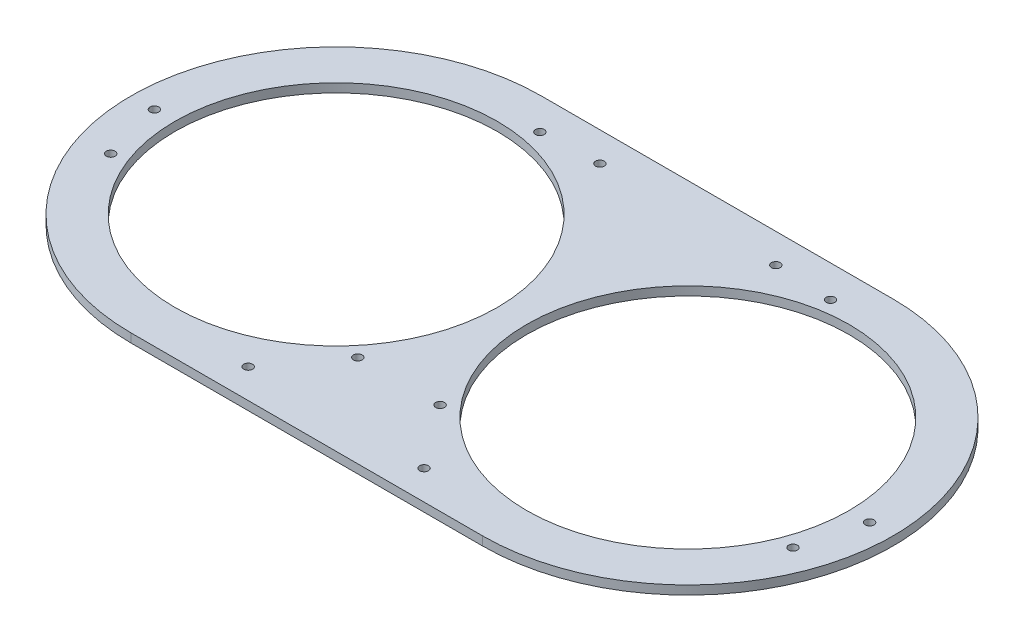
ISO-10303-21;
HEADER;
FILE_DESCRIPTION(('STEP AP214'),'2;1');
FILE_NAME('part.step','',(''),(''),'','','');
FILE_SCHEMA(('AUTOMOTIVE_DESIGN { 1 0 10303 214 1 1 1 1 }'));
ENDSEC;
DATA;
#1=APPLICATION_CONTEXT('core data for automotive mechanical design processes');
#2=APPLICATION_PROTOCOL_DEFINITION('international standard','automotive_design',2000,#1);
#3=PRODUCT_CONTEXT('',#1,'mechanical');
#4=PRODUCT('Part','Part','',(#3));
#5=PRODUCT_RELATED_PRODUCT_CATEGORY('part','',(#4));
#6=PRODUCT_DEFINITION_FORMATION('','',#4);
#7=PRODUCT_DEFINITION_CONTEXT('part definition',#1,'design');
#8=PRODUCT_DEFINITION('design','',#6,#7);
#9=PRODUCT_DEFINITION_SHAPE('','',#8);
#10=(LENGTH_UNIT() NAMED_UNIT(*) SI_UNIT(.MILLI.,.METRE.));
#11=(NAMED_UNIT(*) PLANE_ANGLE_UNIT() SI_UNIT($,.RADIAN.));
#12=(NAMED_UNIT(*) SI_UNIT($,.STERADIAN.) SOLID_ANGLE_UNIT());
#13=UNCERTAINTY_MEASURE_WITH_UNIT(LENGTH_MEASURE(1.E-05),#10,'distance_accuracy_value','');
#14=(GEOMETRIC_REPRESENTATION_CONTEXT(3) GLOBAL_UNCERTAINTY_ASSIGNED_CONTEXT((#13)) GLOBAL_UNIT_ASSIGNED_CONTEXT((#10,
#11,#12)) REPRESENTATION_CONTEXT('',''));
#15=CARTESIAN_POINT('',(0.,0.,0.));
#16=DIRECTION('',(0.,0.,1.));
#17=DIRECTION('',(1.,0.,0.));
#18=AXIS2_PLACEMENT_3D('',#15,#16,#17);
#19=CARTESIAN_POINT('',(0.,3.,70.));
#20=DIRECTION('',(0.,0.,-1.));
#21=DIRECTION('',(-1.,0.,0.));
#22=AXIS2_PLACEMENT_3D('',#19,#20,#21);
#23=PLANE('',#22);
#24=DIRECTION('',(1.,0.,0.));
#25=VECTOR('',#24,1.);
#26=CARTESIAN_POINT('',(0.,0.,70.));
#27=LINE('',#26,#25);
#28=CARTESIAN_POINT('',(-60.,0.,70.));
#29=VERTEX_POINT('',#28);
#30=CARTESIAN_POINT('',(60.,0.,70.));
#31=VERTEX_POINT('',#30);
#32=EDGE_CURVE('E166',#29,#31,#27,.T.);
#33=ORIENTED_EDGE('',*,*,#32,.T.);
#34=DIRECTION('',(0.,-1.,0.));
#35=VECTOR('',#34,1.);
#36=CARTESIAN_POINT('',(60.,3.,70.));
#37=LINE('',#36,#35);
#38=CARTESIAN_POINT('',(60.,3.,70.));
#39=VERTEX_POINT('',#38);
#40=EDGE_CURVE('E11',#39,#31,#37,.T.);
#41=ORIENTED_EDGE('',*,*,#40,.F.);
#42=DIRECTION('',(1.,0.,0.));
#43=VECTOR('',#42,1.);
#44=CARTESIAN_POINT('',(0.,3.,70.));
#45=LINE('',#44,#43);
#46=CARTESIAN_POINT('',(-60.,3.,70.));
#47=VERTEX_POINT('',#46);
#48=EDGE_CURVE('E91',#47,#39,#45,.T.);
#49=ORIENTED_EDGE('',*,*,#48,.F.);
#50=DIRECTION('',(0.,-1.,0.));
#51=VECTOR('',#50,1.);
#52=CARTESIAN_POINT('',(-60.,3.,70.));
#53=LINE('',#52,#51);
#54=EDGE_CURVE('E153',#47,#29,#53,.T.);
#55=ORIENTED_EDGE('',*,*,#54,.T.);
#56=EDGE_LOOP('',(#33,#41,#49,#55));
#57=FACE_BOUND('',#56,.T.);
#58=ADVANCED_FACE('F41',(#57),#23,.F.);
#59=CARTESIAN_POINT('',(60.,3.,0.));
#60=DIRECTION('',(0.,-1.,0.));
#61=DIRECTION('',(0.,0.,-1.));
#62=AXIS2_PLACEMENT_3D('',#59,#60,#61);
#63=CYLINDRICAL_SURFACE('',#62,70.);
#64=CARTESIAN_POINT('',(60.,0.,0.));
#65=DIRECTION('',(0.,1.,0.));
#66=DIRECTION('',(0.,0.,1.));
#67=AXIS2_PLACEMENT_3D('',#64,#65,#66);
#68=CIRCLE('',#67,70.);
#69=CARTESIAN_POINT('',(60.,0.,-70.));
#70=VERTEX_POINT('',#69);
#71=EDGE_CURVE('E97',#31,#70,#68,.T.);
#72=ORIENTED_EDGE('',*,*,#71,.T.);
#73=DIRECTION('',(0.,-1.,0.));
#74=VECTOR('',#73,1.);
#75=CARTESIAN_POINT('',(60.,3.,-70.));
#76=LINE('',#75,#74);
#77=CARTESIAN_POINT('',(60.,3.,-70.));
#78=VERTEX_POINT('',#77);
#79=EDGE_CURVE('E51',#78,#70,#76,.T.);
#80=ORIENTED_EDGE('',*,*,#79,.F.);
#81=CARTESIAN_POINT('',(60.,3.,0.));
#82=DIRECTION('',(0.,1.,0.));
#83=DIRECTION('',(0.,0.,1.));
#84=AXIS2_PLACEMENT_3D('',#81,#82,#83);
#85=CIRCLE('',#84,70.);
#86=EDGE_CURVE('E85',#39,#78,#85,.T.);
#87=ORIENTED_EDGE('',*,*,#86,.F.);
#88=ORIENTED_EDGE('',*,*,#40,.T.);
#89=EDGE_LOOP('',(#72,#80,#87,#88));
#90=FACE_BOUND('',#89,.T.);
#91=ADVANCED_FACE('F96',(#90),#63,.T.);
#92=CARTESIAN_POINT('',(0.,3.,-70.));
#93=DIRECTION('',(0.,0.,-1.));
#94=DIRECTION('',(-1.,0.,0.));
#95=AXIS2_PLACEMENT_3D('',#92,#93,#94);
#96=PLANE('',#95);
#97=DIRECTION('',(1.,0.,0.));
#98=VECTOR('',#97,1.);
#99=CARTESIAN_POINT('',(0.,0.,-70.));
#100=LINE('',#99,#98);
#101=CARTESIAN_POINT('',(-60.,0.,-70.));
#102=VERTEX_POINT('',#101);
#103=EDGE_CURVE('E172',#102,#70,#100,.T.);
#104=ORIENTED_EDGE('',*,*,#103,.F.);
#105=DIRECTION('',(0.,-1.,0.));
#106=VECTOR('',#105,1.);
#107=CARTESIAN_POINT('',(-60.,3.,-70.));
#108=LINE('',#107,#106);
#109=CARTESIAN_POINT('',(-60.,3.,-70.));
#110=VERTEX_POINT('',#109);
#111=EDGE_CURVE('E75',#110,#102,#108,.T.);
#112=ORIENTED_EDGE('',*,*,#111,.F.);
#113=DIRECTION('',(1.,0.,0.));
#114=VECTOR('',#113,1.);
#115=CARTESIAN_POINT('',(0.,3.,-70.));
#116=LINE('',#115,#114);
#117=EDGE_CURVE('E89',#110,#78,#116,.T.);
#118=ORIENTED_EDGE('',*,*,#117,.T.);
#119=ORIENTED_EDGE('',*,*,#79,.T.);
#120=EDGE_LOOP('',(#104,#112,#118,#119));
#121=FACE_BOUND('',#120,.T.);
#122=ADVANCED_FACE('F102',(#121),#96,.T.);
#123=CARTESIAN_POINT('',(14.0373334128611,3.,38.5672565811921));
#124=DIRECTION('',(0.,-1.,0.));
#125=DIRECTION('',(0.,0.,-1.));
#126=AXIS2_PLACEMENT_3D('',#123,#124,#125);
#127=CYLINDRICAL_SURFACE('',#126,1.5);
#128=CARTESIAN_POINT('',(14.0373334128611,3.,38.5672565811921));
#129=DIRECTION('',(0.,1.,0.));
#130=DIRECTION('',(0.,0.,1.));
#131=AXIS2_PLACEMENT_3D('',#128,#129,#130);
#132=CIRCLE('',#131,1.5);
#133=CARTESIAN_POINT('',(14.0373334128611,3.,40.0672565811921));
#134=VERTEX_POINT('',#133);
#135=EDGE_CURVE('E145',#134,#134,#132,.F.);
#136=ORIENTED_EDGE('',*,*,#135,.F.);
#137=EDGE_LOOP('',(#136));
#138=FACE_BOUND('',#137,.T.);
#139=CARTESIAN_POINT('',(14.0373334128611,0.,38.5672565811921));
#140=DIRECTION('',(0.,1.,0.));
#141=DIRECTION('',(0.,0.,1.));
#142=AXIS2_PLACEMENT_3D('',#139,#140,#141);
#143=CIRCLE('',#142,1.5);
#144=CARTESIAN_POINT('',(14.0373334128611,0.,40.0672565811921));
#145=VERTEX_POINT('',#144);
#146=EDGE_CURVE('E213',#145,#145,#143,.F.);
#147=ORIENTED_EDGE('',*,*,#146,.T.);
#148=EDGE_LOOP('',(#147));
#149=FACE_BOUND('',#148,.T.);
#150=ADVANCED_FACE('F428',(#138,#149),#127,.F.);
#151=CARTESIAN_POINT('',(-14.0373334128611,3.,38.5672565811921));
#152=DIRECTION('',(0.,-1.,0.));
#153=DIRECTION('',(0.,0.,-1.));
#154=AXIS2_PLACEMENT_3D('',#151,#152,#153);
#155=CYLINDRICAL_SURFACE('',#154,1.5);
#156=CARTESIAN_POINT('',(-14.0373334128611,3.,38.5672565811921));
#157=DIRECTION('',(0.,1.,0.));
#158=DIRECTION('',(0.,0.,1.));
#159=AXIS2_PLACEMENT_3D('',#156,#157,#158);
#160=CIRCLE('',#159,1.5);
#161=CARTESIAN_POINT('',(-14.0373334128611,3.,40.0672565811921));
#162=VERTEX_POINT('',#161);
#163=EDGE_CURVE('E141',#162,#162,#160,.T.);
#164=ORIENTED_EDGE('',*,*,#163,.T.);
#165=EDGE_LOOP('',(#164));
#166=FACE_BOUND('',#165,.T.);
#167=CARTESIAN_POINT('',(-14.0373334128611,0.,38.5672565811921));
#168=DIRECTION('',(0.,1.,0.));
#169=DIRECTION('',(0.,0.,1.));
#170=AXIS2_PLACEMENT_3D('',#167,#168,#169);
#171=CIRCLE('',#170,1.5);
#172=CARTESIAN_POINT('',(-14.0373334128611,0.,40.0672565811921));
#173=VERTEX_POINT('',#172);
#174=EDGE_CURVE('E209',#173,#173,#171,.T.);
#175=ORIENTED_EDGE('',*,*,#174,.F.);
#176=EDGE_LOOP('',(#175));
#177=FACE_BOUND('',#176,.T.);
#178=ADVANCED_FACE('F419',(#166,#177),#155,.F.);
#179=CARTESIAN_POINT('',(-116.381557247154,3.,20.5212085995402));
#180=DIRECTION('',(0.,-1.,0.));
#181=DIRECTION('',(0.,0.,-1.));
#182=AXIS2_PLACEMENT_3D('',#179,#180,#181);
#183=CYLINDRICAL_SURFACE('',#182,1.5);
#184=CARTESIAN_POINT('',(-116.381557247154,3.,20.5212085995402));
#185=DIRECTION('',(0.,1.,0.));
#186=DIRECTION('',(0.,0.,1.));
#187=AXIS2_PLACEMENT_3D('',#184,#185,#186);
#188=CIRCLE('',#187,1.5);
#189=CARTESIAN_POINT('',(-116.381557247154,3.,22.0212085995402));
#190=VERTEX_POINT('',#189);
#191=EDGE_CURVE('E137',#190,#190,#188,.T.);
#192=ORIENTED_EDGE('',*,*,#191,.T.);
#193=EDGE_LOOP('',(#192));
#194=FACE_BOUND('',#193,.T.);
#195=CARTESIAN_POINT('',(-116.381557247154,0.,20.5212085995402));
#196=DIRECTION('',(0.,1.,0.));
#197=DIRECTION('',(0.,0.,1.));
#198=AXIS2_PLACEMENT_3D('',#195,#196,#197);
#199=CIRCLE('',#198,1.5);
#200=CARTESIAN_POINT('',(-116.381557247154,0.,22.0212085995402));
#201=VERTEX_POINT('',#200);
#202=EDGE_CURVE('E205',#201,#201,#199,.T.);
#203=ORIENTED_EDGE('',*,*,#202,.F.);
#204=EDGE_LOOP('',(#203));
#205=FACE_BOUND('',#204,.T.);
#206=ADVANCED_FACE('F410',(#194,#205),#183,.F.);
#207=CARTESIAN_POINT('',(-49.5811093399839,3.,-59.0884651807324));
#208=DIRECTION('',(0.,-1.,0.));
#209=DIRECTION('',(0.,0.,-1.));
#210=AXIS2_PLACEMENT_3D('',#207,#208,#209);
#211=CYLINDRICAL_SURFACE('',#210,1.5);
#212=CARTESIAN_POINT('',(-49.5811093399839,3.,-59.0884651807324));
#213=DIRECTION('',(0.,1.,0.));
#214=DIRECTION('',(0.,0.,1.));
#215=AXIS2_PLACEMENT_3D('',#212,#213,#214);
#216=CIRCLE('',#215,1.5);
#217=CARTESIAN_POINT('',(-49.5811093399839,3.,-57.5884651807324));
#218=VERTEX_POINT('',#217);
#219=EDGE_CURVE('E133',#218,#218,#216,.T.);
#220=ORIENTED_EDGE('',*,*,#219,.T.);
#221=EDGE_LOOP('',(#220));
#222=FACE_BOUND('',#221,.T.);
#223=CARTESIAN_POINT('',(-49.5811093399839,0.,-59.0884651807324));
#224=DIRECTION('',(0.,1.,0.));
#225=DIRECTION('',(0.,0.,1.));
#226=AXIS2_PLACEMENT_3D('',#223,#224,#225);
#227=CIRCLE('',#226,1.5);
#228=CARTESIAN_POINT('',(-49.5811093399839,0.,-57.5884651807324));
#229=VERTEX_POINT('',#228);
#230=EDGE_CURVE('E201',#229,#229,#227,.T.);
#231=ORIENTED_EDGE('',*,*,#230,.F.);
#232=EDGE_LOOP('',(#231));
#233=FACE_BOUND('',#232,.T.);
#234=ADVANCED_FACE('F401',(#222,#233),#211,.F.);
#235=CARTESIAN_POINT('',(30.,3.,-60.));
#236=DIRECTION('',(0.,-1.,0.));
#237=DIRECTION('',(0.,0.,-1.));
#238=AXIS2_PLACEMENT_3D('',#235,#236,#237);
#239=CYLINDRICAL_SURFACE('',#238,1.5);
#240=CARTESIAN_POINT('',(30.,3.,-60.));
#241=DIRECTION('',(0.,1.,0.));
#242=DIRECTION('',(0.,0.,1.));
#243=AXIS2_PLACEMENT_3D('',#240,#241,#242);
#244=CIRCLE('',#243,1.5);
#245=CARTESIAN_POINT('',(30.,3.,-58.5));
#246=VERTEX_POINT('',#245);
#247=EDGE_CURVE('E129',#246,#246,#244,.F.);
#248=ORIENTED_EDGE('',*,*,#247,.F.);
#249=EDGE_LOOP('',(#248));
#250=FACE_BOUND('',#249,.T.);
#251=CARTESIAN_POINT('',(30.,0.,-60.));
#252=DIRECTION('',(0.,1.,0.));
#253=DIRECTION('',(0.,0.,1.));
#254=AXIS2_PLACEMENT_3D('',#251,#252,#253);
#255=CIRCLE('',#254,1.5);
#256=CARTESIAN_POINT('',(30.,0.,-58.5));
#257=VERTEX_POINT('',#256);
#258=EDGE_CURVE('E197',#257,#257,#255,.F.);
#259=ORIENTED_EDGE('',*,*,#258,.T.);
#260=EDGE_LOOP('',(#259));
#261=FACE_BOUND('',#260,.T.);
#262=ADVANCED_FACE('F392',(#250,#261),#239,.F.);
#263=CARTESIAN_POINT('',(-30.,3.,-60.));
#264=DIRECTION('',(0.,-1.,0.));
#265=DIRECTION('',(0.,0.,-1.));
#266=AXIS2_PLACEMENT_3D('',#263,#264,#265);
#267=CYLINDRICAL_SURFACE('',#266,1.5);
#268=CARTESIAN_POINT('',(-30.,3.,-60.));
#269=DIRECTION('',(0.,1.,0.));
#270=DIRECTION('',(0.,0.,1.));
#271=AXIS2_PLACEMENT_3D('',#268,#269,#270);
#272=CIRCLE('',#271,1.5);
#273=CARTESIAN_POINT('',(-30.,3.,-58.5));
#274=VERTEX_POINT('',#273);
#275=EDGE_CURVE('E125',#274,#274,#272,.T.);
#276=ORIENTED_EDGE('',*,*,#275,.T.);
#277=EDGE_LOOP('',(#276));
#278=FACE_BOUND('',#277,.T.);
#279=CARTESIAN_POINT('',(-30.,0.,-60.));
#280=DIRECTION('',(0.,1.,0.));
#281=DIRECTION('',(0.,0.,1.));
#282=AXIS2_PLACEMENT_3D('',#279,#280,#281);
#283=CIRCLE('',#282,1.5);
#284=CARTESIAN_POINT('',(-30.,0.,-58.5));
#285=VERTEX_POINT('',#284);
#286=EDGE_CURVE('E193',#285,#285,#283,.T.);
#287=ORIENTED_EDGE('',*,*,#286,.F.);
#288=EDGE_LOOP('',(#287));
#289=FACE_BOUND('',#288,.T.);
#290=ADVANCED_FACE('F383',(#278,#289),#267,.F.);
#291=CARTESIAN_POINT('',(122.,3.,0.));
#292=DIRECTION('',(0.,-1.,0.));
#293=DIRECTION('',(0.,0.,-1.));
#294=AXIS2_PLACEMENT_3D('',#291,#292,#293);
#295=CYLINDRICAL_SURFACE('',#294,1.5);
#296=CARTESIAN_POINT('',(122.,3.,0.));
#297=DIRECTION('',(0.,1.,0.));
#298=DIRECTION('',(0.,0.,1.));
#299=AXIS2_PLACEMENT_3D('',#296,#297,#298);
#300=CIRCLE('',#299,1.5);
#301=CARTESIAN_POINT('',(122.,3.,1.5));
#302=VERTEX_POINT('',#301);
#303=EDGE_CURVE('E121',#302,#302,#300,.T.);
#304=ORIENTED_EDGE('',*,*,#303,.T.);
#305=EDGE_LOOP('',(#304));
#306=FACE_BOUND('',#305,.T.);
#307=CARTESIAN_POINT('',(122.,0.,0.));
#308=DIRECTION('',(0.,1.,0.));
#309=DIRECTION('',(0.,0.,1.));
#310=AXIS2_PLACEMENT_3D('',#307,#308,#309);
#311=CIRCLE('',#310,1.5);
#312=CARTESIAN_POINT('',(122.,0.,1.5));
#313=VERTEX_POINT('',#312);
#314=EDGE_CURVE('E189',#313,#313,#311,.T.);
#315=ORIENTED_EDGE('',*,*,#314,.F.);
#316=EDGE_LOOP('',(#315));
#317=FACE_BOUND('',#316,.T.);
#318=ADVANCED_FACE('F374',(#306,#317),#295,.F.);
#319=CARTESIAN_POINT('',(-122.,3.,0.));
#320=DIRECTION('',(0.,-1.,0.));
#321=DIRECTION('',(0.,0.,-1.));
#322=AXIS2_PLACEMENT_3D('',#319,#320,#321);
#323=CYLINDRICAL_SURFACE('',#322,1.5);
#324=CARTESIAN_POINT('',(-122.,3.,0.));
#325=DIRECTION('',(0.,1.,0.));
#326=DIRECTION('',(0.,0.,1.));
#327=AXIS2_PLACEMENT_3D('',#324,#325,#326);
#328=CIRCLE('',#327,1.5);
#329=CARTESIAN_POINT('',(-122.,3.,1.5));
#330=VERTEX_POINT('',#329);
#331=EDGE_CURVE('E117',#330,#330,#328,.T.);
#332=ORIENTED_EDGE('',*,*,#331,.T.);
#333=EDGE_LOOP('',(#332));
#334=FACE_BOUND('',#333,.T.);
#335=CARTESIAN_POINT('',(-122.,0.,0.));
#336=DIRECTION('',(0.,1.,0.));
#337=DIRECTION('',(0.,0.,1.));
#338=AXIS2_PLACEMENT_3D('',#335,#336,#337);
#339=CIRCLE('',#338,1.5);
#340=CARTESIAN_POINT('',(-122.,0.,1.5));
#341=VERTEX_POINT('',#340);
#342=EDGE_CURVE('E185',#341,#341,#339,.T.);
#343=ORIENTED_EDGE('',*,*,#342,.F.);
#344=EDGE_LOOP('',(#343));
#345=FACE_BOUND('',#344,.T.);
#346=ADVANCED_FACE('F365',(#334,#345),#323,.F.);
#347=CARTESIAN_POINT('',(60.,3.,0.));
#348=DIRECTION('',(0.,-1.,0.));
#349=DIRECTION('',(0.,0.,-1.));
#350=AXIS2_PLACEMENT_3D('',#347,#348,#349);
#351=CYLINDRICAL_SURFACE('',#350,55.);
#352=CARTESIAN_POINT('',(60.,3.,0.));
#353=DIRECTION('',(0.,1.,0.));
#354=DIRECTION('',(0.,0.,1.));
#355=AXIS2_PLACEMENT_3D('',#352,#353,#354);
#356=CIRCLE('',#355,55.);
#357=CARTESIAN_POINT('',(60.,3.,55.));
#358=VERTEX_POINT('',#357);
#359=EDGE_CURVE('E113',#358,#358,#356,.F.);
#360=ORIENTED_EDGE('',*,*,#359,.F.);
#361=EDGE_LOOP('',(#360));
#362=FACE_BOUND('',#361,.T.);
#363=CARTESIAN_POINT('',(60.,0.,0.));
#364=DIRECTION('',(0.,1.,0.));
#365=DIRECTION('',(0.,0.,1.));
#366=AXIS2_PLACEMENT_3D('',#363,#364,#365);
#367=CIRCLE('',#366,55.);
#368=CARTESIAN_POINT('',(60.,0.,55.));
#369=VERTEX_POINT('',#368);
#370=EDGE_CURVE('E181',#369,#369,#367,.F.);
#371=ORIENTED_EDGE('',*,*,#370,.T.);
#372=EDGE_LOOP('',(#371));
#373=FACE_BOUND('',#372,.T.);
#374=ADVANCED_FACE('F356',(#362,#373),#351,.F.);
#375=CARTESIAN_POINT('',(-60.,3.,0.));
#376=DIRECTION('',(0.,-1.,0.));
#377=DIRECTION('',(0.,0.,-1.));
#378=AXIS2_PLACEMENT_3D('',#375,#376,#377);
#379=CYLINDRICAL_SURFACE('',#378,55.);
#380=CARTESIAN_POINT('',(-60.,3.,0.));
#381=DIRECTION('',(0.,1.,0.));
#382=DIRECTION('',(0.,0.,1.));
#383=AXIS2_PLACEMENT_3D('',#380,#381,#382);
#384=CIRCLE('',#383,55.);
#385=CARTESIAN_POINT('',(-60.,3.,55.));
#386=VERTEX_POINT('',#385);
#387=EDGE_CURVE('E106',#386,#386,#384,.T.);
#388=ORIENTED_EDGE('',*,*,#387,.T.);
#389=EDGE_LOOP('',(#388));
#390=FACE_BOUND('',#389,.T.);
#391=CARTESIAN_POINT('',(-60.,0.,0.));
#392=DIRECTION('',(0.,1.,0.));
#393=DIRECTION('',(0.,0.,1.));
#394=AXIS2_PLACEMENT_3D('',#391,#392,#393);
#395=CIRCLE('',#394,55.);
#396=CARTESIAN_POINT('',(-60.,0.,55.));
#397=VERTEX_POINT('',#396);
#398=EDGE_CURVE('E177',#397,#397,#395,.T.);
#399=ORIENTED_EDGE('',*,*,#398,.F.);
#400=EDGE_LOOP('',(#399));
#401=FACE_BOUND('',#400,.T.);
#402=ADVANCED_FACE('F348',(#390,#401),#379,.F.);
#403=CARTESIAN_POINT('',(-60.,3.,0.));
#404=DIRECTION('',(0.,-1.,0.));
#405=DIRECTION('',(0.,0.,-1.));
#406=AXIS2_PLACEMENT_3D('',#403,#404,#405);
#407=CYLINDRICAL_SURFACE('',#406,70.);
#408=CARTESIAN_POINT('',(-60.,0.,0.));
#409=DIRECTION('',(0.,1.,0.));
#410=DIRECTION('',(0.,0.,1.));
#411=AXIS2_PLACEMENT_3D('',#408,#409,#410);
#412=CIRCLE('',#411,70.);
#413=EDGE_CURVE('E78',#102,#29,#412,.T.);
#414=ORIENTED_EDGE('',*,*,#413,.T.);
#415=ORIENTED_EDGE('',*,*,#54,.F.);
#416=CARTESIAN_POINT('',(-60.,3.,0.));
#417=DIRECTION('',(0.,1.,0.));
#418=DIRECTION('',(0.,0.,1.));
#419=AXIS2_PLACEMENT_3D('',#416,#417,#418);
#420=CIRCLE('',#419,70.);
#421=EDGE_CURVE('E59',#110,#47,#420,.T.);
#422=ORIENTED_EDGE('',*,*,#421,.F.);
#423=ORIENTED_EDGE('',*,*,#111,.T.);
#424=EDGE_LOOP('',(#414,#415,#422,#423));
#425=FACE_BOUND('',#424,.T.);
#426=ADVANCED_FACE('F279',(#425),#407,.T.);
#427=CARTESIAN_POINT('',(30.,3.,60.));
#428=DIRECTION('',(0.,-1.,0.));
#429=DIRECTION('',(0.,0.,-1.));
#430=AXIS2_PLACEMENT_3D('',#427,#428,#429);
#431=CYLINDRICAL_SURFACE('',#430,1.5);
#432=CARTESIAN_POINT('',(30.,3.,60.));
#433=DIRECTION('',(0.,1.,0.));
#434=DIRECTION('',(0.,0.,1.));
#435=AXIS2_PLACEMENT_3D('',#432,#433,#434);
#436=CIRCLE('',#435,1.5);
#437=CARTESIAN_POINT('',(30.,3.,61.5));
#438=VERTEX_POINT('',#437);
#439=EDGE_CURVE('E296',#438,#438,#436,.T.);
#440=ORIENTED_EDGE('',*,*,#439,.T.);
#441=EDGE_LOOP('',(#440));
#442=FACE_BOUND('',#441,.T.);
#443=CARTESIAN_POINT('',(30.,0.,60.));
#444=DIRECTION('',(0.,1.,0.));
#445=DIRECTION('',(0.,0.,1.));
#446=AXIS2_PLACEMENT_3D('',#443,#444,#445);
#447=CIRCLE('',#446,1.5);
#448=CARTESIAN_POINT('',(30.,0.,61.5));
#449=VERTEX_POINT('',#448);
#450=EDGE_CURVE('E162',#449,#449,#447,.T.);
#451=ORIENTED_EDGE('',*,*,#450,.F.);
#452=EDGE_LOOP('',(#451));
#453=FACE_BOUND('',#452,.T.);
#454=ADVANCED_FACE('F277',(#442,#453),#431,.F.);
#455=CARTESIAN_POINT('',(-30.,3.,60.));
#456=DIRECTION('',(0.,-1.,0.));
#457=DIRECTION('',(0.,0.,-1.));
#458=AXIS2_PLACEMENT_3D('',#455,#456,#457);
#459=CYLINDRICAL_SURFACE('',#458,1.5);
#460=CARTESIAN_POINT('',(-30.,3.,60.));
#461=DIRECTION('',(0.,1.,0.));
#462=DIRECTION('',(0.,0.,1.));
#463=AXIS2_PLACEMENT_3D('',#460,#461,#462);
#464=CIRCLE('',#463,1.5);
#465=CARTESIAN_POINT('',(-30.,3.,61.5));
#466=VERTEX_POINT('',#465);
#467=EDGE_CURVE('E288',#466,#466,#464,.F.);
#468=ORIENTED_EDGE('',*,*,#467,.F.);
#469=EDGE_LOOP('',(#468));
#470=FACE_BOUND('',#469,.T.);
#471=CARTESIAN_POINT('',(-30.,0.,60.));
#472=DIRECTION('',(0.,1.,0.));
#473=DIRECTION('',(0.,0.,1.));
#474=AXIS2_PLACEMENT_3D('',#471,#472,#473);
#475=CIRCLE('',#474,1.5);
#476=CARTESIAN_POINT('',(-30.,0.,61.5));
#477=VERTEX_POINT('',#476);
#478=EDGE_CURVE('E158',#477,#477,#475,.F.);
#479=ORIENTED_EDGE('',*,*,#478,.T.);
#480=EDGE_LOOP('',(#479));
#481=FACE_BOUND('',#480,.T.);
#482=ADVANCED_FACE('F265',(#470,#481),#459,.F.);
#483=CARTESIAN_POINT('',(116.381557247154,3.,20.5212085995402));
#484=DIRECTION('',(0.,-1.,0.));
#485=DIRECTION('',(0.,0.,-1.));
#486=AXIS2_PLACEMENT_3D('',#483,#484,#485);
#487=CYLINDRICAL_SURFACE('',#486,1.5);
#488=CARTESIAN_POINT('',(116.381557247154,3.,20.5212085995402));
#489=DIRECTION('',(0.,1.,0.));
#490=DIRECTION('',(0.,0.,1.));
#491=AXIS2_PLACEMENT_3D('',#488,#489,#490);
#492=CIRCLE('',#491,1.5);
#493=CARTESIAN_POINT('',(116.381557247154,3.,22.0212085995402));
#494=VERTEX_POINT('',#493);
#495=EDGE_CURVE('E221',#494,#494,#492,.F.);
#496=ORIENTED_EDGE('',*,*,#495,.F.);
#497=EDGE_LOOP('',(#496));
#498=FACE_BOUND('',#497,.T.);
#499=CARTESIAN_POINT('',(116.381557247154,0.,20.5212085995402));
#500=DIRECTION('',(0.,1.,0.));
#501=DIRECTION('',(0.,0.,1.));
#502=AXIS2_PLACEMENT_3D('',#499,#500,#501);
#503=CIRCLE('',#502,1.5);
#504=CARTESIAN_POINT('',(116.381557247154,0.,22.0212085995402));
#505=VERTEX_POINT('',#504);
#506=EDGE_CURVE('E154',#505,#505,#503,.F.);
#507=ORIENTED_EDGE('',*,*,#506,.T.);
#508=EDGE_LOOP('',(#507));
#509=FACE_BOUND('',#508,.T.);
#510=ADVANCED_FACE('F43',(#498,#509),#487,.F.);
#511=CARTESIAN_POINT('',(49.5811093399839,3.,-59.0884651807324));
#512=DIRECTION('',(0.,-1.,0.));
#513=DIRECTION('',(0.,0.,-1.));
#514=AXIS2_PLACEMENT_3D('',#511,#512,#513);
#515=CYLINDRICAL_SURFACE('',#514,1.5);
#516=CARTESIAN_POINT('',(49.5811093399839,3.,-59.0884651807324));
#517=DIRECTION('',(0.,1.,0.));
#518=DIRECTION('',(0.,0.,1.));
#519=AXIS2_PLACEMENT_3D('',#516,#517,#518);
#520=CIRCLE('',#519,1.5);
#521=CARTESIAN_POINT('',(49.5811093399839,3.,-57.5884651807324));
#522=VERTEX_POINT('',#521);
#523=EDGE_CURVE('E149',#522,#522,#520,.F.);
#524=ORIENTED_EDGE('',*,*,#523,.F.);
#525=EDGE_LOOP('',(#524));
#526=FACE_BOUND('',#525,.T.);
#527=CARTESIAN_POINT('',(49.5811093399839,0.,-59.0884651807324));
#528=DIRECTION('',(0.,1.,0.));
#529=DIRECTION('',(0.,0.,1.));
#530=AXIS2_PLACEMENT_3D('',#527,#528,#529);
#531=CIRCLE('',#530,1.5);
#532=CARTESIAN_POINT('',(49.5811093399839,0.,-57.5884651807324));
#533=VERTEX_POINT('',#532);
#534=EDGE_CURVE('E217',#533,#533,#531,.F.);
#535=ORIENTED_EDGE('',*,*,#534,.T.);
#536=EDGE_LOOP('',(#535));
#537=FACE_BOUND('',#536,.T.);
#538=ADVANCED_FACE('F255',(#526,#537),#515,.F.);
#539=CARTESIAN_POINT('',(0.,3.,0.));
#540=DIRECTION('',(0.,1.,0.));
#541=DIRECTION('',(0.,0.,1.));
#542=AXIS2_PLACEMENT_3D('',#539,#540,#541);
#543=PLANE('',#542);
#544=ORIENTED_EDGE('',*,*,#495,.T.);
#545=EDGE_LOOP('',(#544));
#546=FACE_BOUND('',#545,.T.);
#547=ORIENTED_EDGE('',*,*,#467,.T.);
#548=EDGE_LOOP('',(#547));
#549=FACE_BOUND('',#548,.T.);
#550=ORIENTED_EDGE('',*,*,#439,.F.);
#551=EDGE_LOOP('',(#550));
#552=FACE_BOUND('',#551,.T.);
#553=ORIENTED_EDGE('',*,*,#48,.T.);
#554=ORIENTED_EDGE('',*,*,#86,.T.);
#555=ORIENTED_EDGE('',*,*,#117,.F.);
#556=ORIENTED_EDGE('',*,*,#421,.T.);
#557=EDGE_LOOP('',(#553,#554,#555,#556));
#558=FACE_BOUND('',#557,.T.);
#559=ORIENTED_EDGE('',*,*,#387,.F.);
#560=EDGE_LOOP('',(#559));
#561=FACE_BOUND('',#560,.T.);
#562=ORIENTED_EDGE('',*,*,#359,.T.);
#563=EDGE_LOOP('',(#562));
#564=FACE_BOUND('',#563,.T.);
#565=ORIENTED_EDGE('',*,*,#331,.F.);
#566=EDGE_LOOP('',(#565));
#567=FACE_BOUND('',#566,.T.);
#568=ORIENTED_EDGE('',*,*,#303,.F.);
#569=EDGE_LOOP('',(#568));
#570=FACE_BOUND('',#569,.T.);
#571=ORIENTED_EDGE('',*,*,#275,.F.);
#572=EDGE_LOOP('',(#571));
#573=FACE_BOUND('',#572,.T.);
#574=ORIENTED_EDGE('',*,*,#247,.T.);
#575=EDGE_LOOP('',(#574));
#576=FACE_BOUND('',#575,.T.);
#577=ORIENTED_EDGE('',*,*,#219,.F.);
#578=EDGE_LOOP('',(#577));
#579=FACE_BOUND('',#578,.T.);
#580=ORIENTED_EDGE('',*,*,#191,.F.);
#581=EDGE_LOOP('',(#580));
#582=FACE_BOUND('',#581,.T.);
#583=ORIENTED_EDGE('',*,*,#163,.F.);
#584=EDGE_LOOP('',(#583));
#585=FACE_BOUND('',#584,.T.);
#586=ORIENTED_EDGE('',*,*,#135,.T.);
#587=EDGE_LOOP('',(#586));
#588=FACE_BOUND('',#587,.T.);
#589=ORIENTED_EDGE('',*,*,#523,.T.);
#590=EDGE_LOOP('',(#589));
#591=FACE_BOUND('',#590,.T.);
#592=ADVANCED_FACE('F86',(#546,#549,#552,#558,#561,#564,#567,#570,#573,#576,#579,#582,#585,#588,
#591),#543,.T.);
#593=CARTESIAN_POINT('',(0.,0.,0.));
#594=DIRECTION('',(0.,1.,0.));
#595=DIRECTION('',(0.,0.,1.));
#596=AXIS2_PLACEMENT_3D('',#593,#594,#595);
#597=PLANE('',#596);
#598=ORIENTED_EDGE('',*,*,#506,.F.);
#599=EDGE_LOOP('',(#598));
#600=FACE_BOUND('',#599,.T.);
#601=ORIENTED_EDGE('',*,*,#478,.F.);
#602=EDGE_LOOP('',(#601));
#603=FACE_BOUND('',#602,.T.);
#604=ORIENTED_EDGE('',*,*,#450,.T.);
#605=EDGE_LOOP('',(#604));
#606=FACE_BOUND('',#605,.T.);
#607=ORIENTED_EDGE('',*,*,#32,.F.);
#608=ORIENTED_EDGE('',*,*,#413,.F.);
#609=ORIENTED_EDGE('',*,*,#103,.T.);
#610=ORIENTED_EDGE('',*,*,#71,.F.);
#611=EDGE_LOOP('',(#607,#608,#609,#610));
#612=FACE_BOUND('',#611,.T.);
#613=ORIENTED_EDGE('',*,*,#398,.T.);
#614=EDGE_LOOP('',(#613));
#615=FACE_BOUND('',#614,.T.);
#616=ORIENTED_EDGE('',*,*,#370,.F.);
#617=EDGE_LOOP('',(#616));
#618=FACE_BOUND('',#617,.T.);
#619=ORIENTED_EDGE('',*,*,#342,.T.);
#620=EDGE_LOOP('',(#619));
#621=FACE_BOUND('',#620,.T.);
#622=ORIENTED_EDGE('',*,*,#314,.T.);
#623=EDGE_LOOP('',(#622));
#624=FACE_BOUND('',#623,.T.);
#625=ORIENTED_EDGE('',*,*,#286,.T.);
#626=EDGE_LOOP('',(#625));
#627=FACE_BOUND('',#626,.T.);
#628=ORIENTED_EDGE('',*,*,#258,.F.);
#629=EDGE_LOOP('',(#628));
#630=FACE_BOUND('',#629,.T.);
#631=ORIENTED_EDGE('',*,*,#230,.T.);
#632=EDGE_LOOP('',(#631));
#633=FACE_BOUND('',#632,.T.);
#634=ORIENTED_EDGE('',*,*,#202,.T.);
#635=EDGE_LOOP('',(#634));
#636=FACE_BOUND('',#635,.T.);
#637=ORIENTED_EDGE('',*,*,#174,.T.);
#638=EDGE_LOOP('',(#637));
#639=FACE_BOUND('',#638,.T.);
#640=ORIENTED_EDGE('',*,*,#146,.F.);
#641=EDGE_LOOP('',(#640));
#642=FACE_BOUND('',#641,.T.);
#643=ORIENTED_EDGE('',*,*,#534,.F.);
#644=EDGE_LOOP('',(#643));
#645=FACE_BOUND('',#644,.T.);
#646=ADVANCED_FACE('F228',(#600,#603,#606,#612,#615,#618,#621,#624,#627,#630,#633,#636,#639,
#642,#645),#597,.F.);
#647=CLOSED_SHELL('',(#58,#91,#122,#150,#178,#206,#234,#262,#290,#318,#346,#374,#402,#426,#454,
#482,#510,#538,#592,#646));
#648=MANIFOLD_SOLID_BREP('B2',#647);
#649=ADVANCED_BREP_SHAPE_REPRESENTATION('',(#18,#648),#14);
#650=SHAPE_DEFINITION_REPRESENTATION(#9,#649);
ENDSEC;
END-ISO-10303-21;
